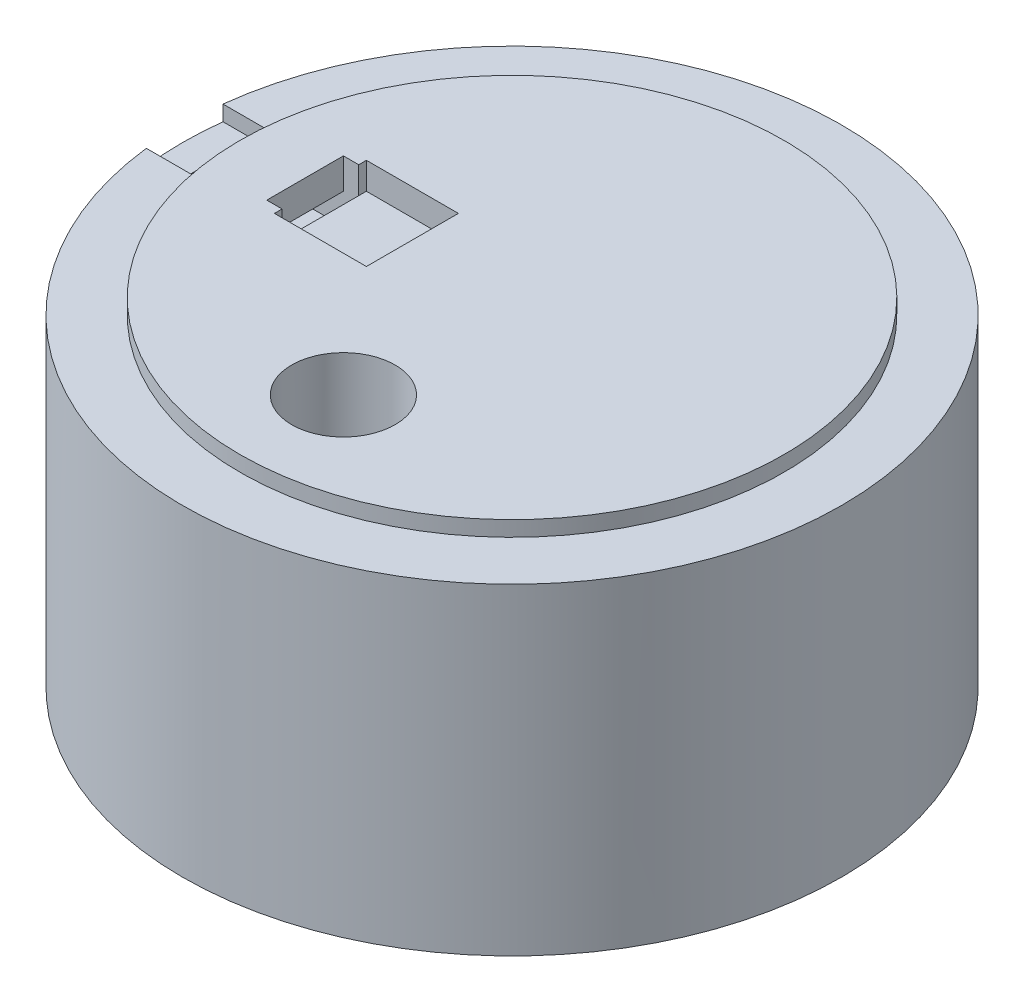
ISO-10303-21;
HEADER;
FILE_DESCRIPTION(('STEP AP214'),'2;1');
FILE_NAME('part.step','',(''),(''),'','','');
FILE_SCHEMA(('AUTOMOTIVE_DESIGN { 1 0 10303 214 1 1 1 1 }'));
ENDSEC;
DATA;
#1=APPLICATION_CONTEXT('core data for automotive mechanical design processes');
#2=APPLICATION_PROTOCOL_DEFINITION('international standard','automotive_design',2000,#1);
#3=PRODUCT_CONTEXT('',#1,'mechanical');
#4=PRODUCT('Part','Part','',(#3));
#5=PRODUCT_RELATED_PRODUCT_CATEGORY('part','',(#4));
#6=PRODUCT_DEFINITION_FORMATION('','',#4);
#7=PRODUCT_DEFINITION_CONTEXT('part definition',#1,'design');
#8=PRODUCT_DEFINITION('design','',#6,#7);
#9=PRODUCT_DEFINITION_SHAPE('','',#8);
#10=(LENGTH_UNIT() NAMED_UNIT(*) SI_UNIT(.MILLI.,.METRE.));
#11=(NAMED_UNIT(*) PLANE_ANGLE_UNIT() SI_UNIT($,.RADIAN.));
#12=(NAMED_UNIT(*) SI_UNIT($,.STERADIAN.) SOLID_ANGLE_UNIT());
#13=UNCERTAINTY_MEASURE_WITH_UNIT(LENGTH_MEASURE(1.E-05),#10,'distance_accuracy_value','');
#14=(GEOMETRIC_REPRESENTATION_CONTEXT(3) GLOBAL_UNCERTAINTY_ASSIGNED_CONTEXT((#13)) GLOBAL_UNIT_ASSIGNED_CONTEXT((#10,
#11,#12)) REPRESENTATION_CONTEXT('',''));
#15=CARTESIAN_POINT('',(0.,0.,0.));
#16=DIRECTION('',(0.,0.,1.));
#17=DIRECTION('',(1.,0.,0.));
#18=AXIS2_PLACEMENT_3D('',#15,#16,#17);
#19=CARTESIAN_POINT('',(0.,30.,0.));
#20=DIRECTION('',(0.,-1.,0.));
#21=DIRECTION('',(0.,0.,-1.));
#22=AXIS2_PLACEMENT_3D('',#19,#20,#21);
#23=PLANE('',#22);
#24=CARTESIAN_POINT('',(0.,30.,0.));
#25=DIRECTION('',(0.,-1.,0.));
#26=DIRECTION('',(0.,0.,-1.));
#27=AXIS2_PLACEMENT_3D('',#24,#25,#26);
#28=CIRCLE('',#27,33.);
#29=CARTESIAN_POINT('',(-3.5,30.,32.8138690190596));
#30=VERTEX_POINT('',#29);
#31=CARTESIAN_POINT('',(-30.1676441669608,30.,-13.3758455962843));
#32=VERTEX_POINT('',#31);
#33=EDGE_CURVE('E306',#30,#32,#28,.T.);
#34=ORIENTED_EDGE('',*,*,#33,.T.);
#35=DIRECTION('',(-0.866025403784438,0.,-0.5));
#36=VECTOR('',#35,1.);
#37=CARTESIAN_POINT('',(-34.2259526419164,30.,-15.7189110867545));
#38=LINE('',#37,#36);
#39=CARTESIAN_POINT('',(-34.2259526419164,30.,-15.7189110867545));
#40=VERTEX_POINT('',#39);
#41=EDGE_CURVE('E309',#32,#40,#38,.T.);
#42=ORIENTED_EDGE('',*,*,#41,.T.);
#43=DIRECTION('',(0.5,0.,-0.866025403784438));
#44=VECTOR('',#43,1.);
#45=CARTESIAN_POINT('',(-30.7259526419164,30.,-21.7810889132456));
#46=LINE('',#45,#44);
#47=CARTESIAN_POINT('',(-30.7259526419164,30.,-21.7810889132456));
#48=VERTEX_POINT('',#47);
#49=EDGE_CURVE('E313',#40,#48,#46,.T.);
#50=ORIENTED_EDGE('',*,*,#49,.T.);
#51=DIRECTION('',(0.866025403784438,0.,0.500000000000001));
#52=VECTOR('',#51,1.);
#53=CARTESIAN_POINT('',(-26.6676441669608,30.,-19.4380234227754));
#54=LINE('',#53,#52);
#55=CARTESIAN_POINT('',(-26.6676441669608,30.,-19.4380234227753));
#56=VERTEX_POINT('',#55);
#57=EDGE_CURVE('E316',#48,#56,#54,.T.);
#58=ORIENTED_EDGE('',*,*,#57,.T.);
#59=CARTESIAN_POINT('',(0.,30.,0.));
#60=DIRECTION('',(0.,-1.,0.));
#61=DIRECTION('',(0.,0.,-1.));
#62=AXIS2_PLACEMENT_3D('',#59,#60,#61);
#63=CIRCLE('',#62,33.);
#64=CARTESIAN_POINT('',(26.6676441669608,30.,-19.4380234227753));
#65=VERTEX_POINT('',#64);
#66=EDGE_CURVE('E319',#56,#65,#63,.T.);
#67=ORIENTED_EDGE('',*,*,#66,.T.);
#68=DIRECTION('',(0.866025403784438,0.,-0.5));
#69=VECTOR('',#68,1.);
#70=CARTESIAN_POINT('',(30.7259526419165,30.,-21.7810889132455));
#71=LINE('',#70,#69);
#72=CARTESIAN_POINT('',(30.7259526419165,30.,-21.7810889132455));
#73=VERTEX_POINT('',#72);
#74=EDGE_CURVE('E322',#65,#73,#71,.T.);
#75=ORIENTED_EDGE('',*,*,#74,.T.);
#76=DIRECTION('',(0.5,0.,0.866025403784439));
#77=VECTOR('',#76,1.);
#78=CARTESIAN_POINT('',(34.2259526419165,30.,-15.7189110867545));
#79=LINE('',#78,#77);
#80=CARTESIAN_POINT('',(34.2259526419165,30.,-15.7189110867545));
#81=VERTEX_POINT('',#80);
#82=EDGE_CURVE('E325',#73,#81,#79,.T.);
#83=ORIENTED_EDGE('',*,*,#82,.T.);
#84=DIRECTION('',(-0.866025403784439,0.,0.5));
#85=VECTOR('',#84,1.);
#86=CARTESIAN_POINT('',(30.1676441669608,30.,-13.3758455962843));
#87=LINE('',#86,#85);
#88=CARTESIAN_POINT('',(30.1676441669608,30.,-13.3758455962843));
#89=VERTEX_POINT('',#88);
#90=EDGE_CURVE('E328',#81,#89,#87,.T.);
#91=ORIENTED_EDGE('',*,*,#90,.T.);
#92=CARTESIAN_POINT('',(0.,30.,0.));
#93=DIRECTION('',(0.,-1.,0.));
#94=DIRECTION('',(0.,0.,-1.));
#95=AXIS2_PLACEMENT_3D('',#92,#93,#94);
#96=CIRCLE('',#95,33.);
#97=CARTESIAN_POINT('',(3.5,30.,32.8138690190596));
#98=VERTEX_POINT('',#97);
#99=EDGE_CURVE('E331',#89,#98,#96,.T.);
#100=ORIENTED_EDGE('',*,*,#99,.T.);
#101=DIRECTION('',(0.,0.,1.));
#102=VECTOR('',#101,1.);
#103=CARTESIAN_POINT('',(3.5,30.,37.5));
#104=LINE('',#103,#102);
#105=CARTESIAN_POINT('',(3.5,30.,37.5));
#106=VERTEX_POINT('',#105);
#107=EDGE_CURVE('E334',#98,#106,#104,.T.);
#108=ORIENTED_EDGE('',*,*,#107,.T.);
#109=DIRECTION('',(-1.,0.,0.));
#110=VECTOR('',#109,1.);
#111=CARTESIAN_POINT('',(-3.5,30.,37.5));
#112=LINE('',#111,#110);
#113=CARTESIAN_POINT('',(-3.5,30.,37.5));
#114=VERTEX_POINT('',#113);
#115=EDGE_CURVE('E337',#106,#114,#112,.T.);
#116=ORIENTED_EDGE('',*,*,#115,.T.);
#117=DIRECTION('',(0.,0.,-1.));
#118=VECTOR('',#117,1.);
#119=CARTESIAN_POINT('',(-3.5,30.,32.8138690190596));
#120=LINE('',#119,#118);
#121=EDGE_CURVE('E340',#114,#30,#120,.T.);
#122=ORIENTED_EDGE('',*,*,#121,.T.);
#123=EDGE_LOOP('',(#34,#42,#50,#58,#67,#75,#83,#91,#100,#108,#116,#122));
#124=FACE_BOUND('',#123,.T.);
#125=CARTESIAN_POINT('',(0.,30.,22.));
#126=DIRECTION('',(0.,-1.,0.));
#127=DIRECTION('',(0.,0.,-1.));
#128=AXIS2_PLACEMENT_3D('',#125,#126,#127);
#129=CIRCLE('',#128,8.75);
#130=CARTESIAN_POINT('',(0.,30.,13.25));
#131=VERTEX_POINT('',#130);
#132=EDGE_CURVE('E613',#131,#131,#129,.T.);
#133=ORIENTED_EDGE('',*,*,#132,.F.);
#134=EDGE_LOOP('',(#133));
#135=FACE_BOUND('',#134,.T.);
#136=ADVANCED_FACE('F38',(#124,#135),#23,.T.);
#137=CARTESIAN_POINT('',(0.,44.,0.));
#138=DIRECTION('',(0.,-1.,0.));
#139=DIRECTION('',(0.,0.,-1.));
#140=AXIS2_PLACEMENT_3D('',#137,#138,#139);
#141=CYLINDRICAL_SURFACE('',#140,35.5);
#142=CARTESIAN_POINT('',(0.,44.,0.));
#143=DIRECTION('',(0.,1.,0.));
#144=DIRECTION('',(0.,0.,1.));
#145=AXIS2_PLACEMENT_3D('',#142,#143,#144);
#146=CIRCLE('',#145,35.5);
#147=CARTESIAN_POINT('',(0.,44.,35.5));
#148=VERTEX_POINT('',#147);
#149=EDGE_CURVE('E379',#148,#148,#146,.T.);
#150=ORIENTED_EDGE('',*,*,#149,.F.);
#151=EDGE_LOOP('',(#150));
#152=FACE_BOUND('',#151,.T.);
#153=DIRECTION('',(0.,1.,0.));
#154=VECTOR('',#153,1.);
#155=CARTESIAN_POINT('',(-35.1461235415799,40.,-4.99999999999999));
#156=LINE('',#155,#154);
#157=CARTESIAN_POINT('',(-35.1461235415799,40.,-5.));
#158=VERTEX_POINT('',#157);
#159=CARTESIAN_POINT('',(-35.1461235415799,42.,-4.99999999999999));
#160=VERTEX_POINT('',#159);
#161=EDGE_CURVE('E506',#158,#160,#156,.T.);
#162=ORIENTED_EDGE('',*,*,#161,.F.);
#163=CARTESIAN_POINT('',(0.,40.,0.));
#164=DIRECTION('',(0.,1.,0.));
#165=DIRECTION('',(0.,0.,1.));
#166=AXIS2_PLACEMENT_3D('',#163,#164,#165);
#167=CIRCLE('',#166,35.5);
#168=CARTESIAN_POINT('',(-35.1461235415799,40.,5.));
#169=VERTEX_POINT('',#168);
#170=EDGE_CURVE('E240',#158,#169,#167,.T.);
#171=ORIENTED_EDGE('',*,*,#170,.T.);
#172=DIRECTION('',(0.,1.,0.));
#173=VECTOR('',#172,1.);
#174=CARTESIAN_POINT('',(-35.1461235415799,40.,4.99999999999999));
#175=LINE('',#174,#173);
#176=CARTESIAN_POINT('',(-35.1461235415799,42.,5.));
#177=VERTEX_POINT('',#176);
#178=EDGE_CURVE('E515',#169,#177,#175,.T.);
#179=ORIENTED_EDGE('',*,*,#178,.T.);
#180=CARTESIAN_POINT('',(0.,42.,0.));
#181=DIRECTION('',(0.,1.,0.));
#182=DIRECTION('',(0.,0.,1.));
#183=AXIS2_PLACEMENT_3D('',#180,#181,#182);
#184=CIRCLE('',#183,35.5);
#185=EDGE_CURVE('E11',#177,#160,#184,.T.);
#186=ORIENTED_EDGE('',*,*,#185,.T.);
#187=EDGE_LOOP('',(#162,#171,#179,#186));
#188=FACE_BOUND('',#187,.T.);
#189=ADVANCED_FACE('F425',(#152,#188),#141,.T.);
#190=CARTESIAN_POINT('',(-25.,40.5,-6.));
#191=DIRECTION('',(-1.,0.,0.));
#192=DIRECTION('',(0.,0.,1.));
#193=AXIS2_PLACEMENT_3D('',#190,#191,#192);
#194=PLANE('',#193);
#195=DIRECTION('',(0.,0.,1.));
#196=VECTOR('',#195,1.);
#197=CARTESIAN_POINT('',(-25.,44.,-6.));
#198=LINE('',#197,#196);
#199=CARTESIAN_POINT('',(-25.,44.,-6.));
#200=VERTEX_POINT('',#199);
#201=CARTESIAN_POINT('',(-25.,44.,-5.));
#202=VERTEX_POINT('',#201);
#203=EDGE_CURVE('E260',#200,#202,#198,.T.);
#204=ORIENTED_EDGE('',*,*,#203,.T.);
#205=DIRECTION('',(0.,1.,0.));
#206=VECTOR('',#205,1.);
#207=CARTESIAN_POINT('',(-25.,36.,-5.));
#208=LINE('',#207,#206);
#209=CARTESIAN_POINT('',(-25.,40.5,-5.));
#210=VERTEX_POINT('',#209);
#211=EDGE_CURVE('E263',#210,#202,#208,.T.);
#212=ORIENTED_EDGE('',*,*,#211,.F.);
#213=DIRECTION('',(0.,0.,1.));
#214=VECTOR('',#213,1.);
#215=CARTESIAN_POINT('',(-25.,40.5,-6.));
#216=LINE('',#215,#214);
#217=CARTESIAN_POINT('',(-25.,40.5,-6.));
#218=VERTEX_POINT('',#217);
#219=EDGE_CURVE('E272',#218,#210,#216,.T.);
#220=ORIENTED_EDGE('',*,*,#219,.F.);
#221=DIRECTION('',(0.,1.,0.));
#222=VECTOR('',#221,1.);
#223=CARTESIAN_POINT('',(-25.,40.5,-6.));
#224=LINE('',#223,#222);
#225=EDGE_CURVE('E297',#218,#200,#224,.T.);
#226=ORIENTED_EDGE('',*,*,#225,.T.);
#227=EDGE_LOOP('',(#204,#212,#220,#226));
#228=FACE_BOUND('',#227,.T.);
#229=ADVANCED_FACE('F437',(#228),#194,.F.);
#230=CARTESIAN_POINT('',(0.,42.,0.));
#231=DIRECTION('',(0.,-1.,0.));
#232=DIRECTION('',(0.,0.,-1.));
#233=AXIS2_PLACEMENT_3D('',#230,#231,#232);
#234=CYLINDRICAL_SURFACE('',#233,43.);
#235=CARTESIAN_POINT('',(0.,40.,0.));
#236=DIRECTION('',(0.,1.,0.));
#237=DIRECTION('',(0.,0.,1.));
#238=AXIS2_PLACEMENT_3D('',#235,#236,#237);
#239=CIRCLE('',#238,43.);
#240=CARTESIAN_POINT('',(-42.7083130081252,40.,-4.99999999999999));
#241=VERTEX_POINT('',#240);
#242=CARTESIAN_POINT('',(-42.7083130081252,40.,5.00000000000001));
#243=VERTEX_POINT('',#242);
#244=EDGE_CURVE('E641',#241,#243,#239,.T.);
#245=ORIENTED_EDGE('',*,*,#244,.F.);
#246=DIRECTION('',(0.,1.,0.));
#247=VECTOR('',#246,1.);
#248=CARTESIAN_POINT('',(-42.7083130081252,40.,-4.99999999999999));
#249=LINE('',#248,#247);
#250=CARTESIAN_POINT('',(-42.7083130081252,42.,-4.99999999999999));
#251=VERTEX_POINT('',#250);
#252=EDGE_CURVE('E513',#241,#251,#249,.T.);
#253=ORIENTED_EDGE('',*,*,#252,.T.);
#254=CARTESIAN_POINT('',(0.,42.,0.));
#255=DIRECTION('',(0.,1.,0.));
#256=DIRECTION('',(0.,0.,1.));
#257=AXIS2_PLACEMENT_3D('',#254,#255,#256);
#258=CIRCLE('',#257,43.);
#259=CARTESIAN_POINT('',(-42.7083130081252,42.,5.00000000000001));
#260=VERTEX_POINT('',#259);
#261=EDGE_CURVE('E47',#260,#251,#258,.T.);
#262=ORIENTED_EDGE('',*,*,#261,.F.);
#263=DIRECTION('',(0.,1.,0.));
#264=VECTOR('',#263,1.);
#265=CARTESIAN_POINT('',(-42.7083130081252,40.,5.00000000000001));
#266=LINE('',#265,#264);
#267=EDGE_CURVE('E520',#243,#260,#266,.T.);
#268=ORIENTED_EDGE('',*,*,#267,.F.);
#269=EDGE_LOOP('',(#245,#253,#262,#268));
#270=FACE_BOUND('',#269,.T.);
#271=CARTESIAN_POINT('',(0.,0.,0.));
#272=DIRECTION('',(0.,1.,0.));
#273=DIRECTION('',(0.,0.,1.));
#274=AXIS2_PLACEMENT_3D('',#271,#272,#273);
#275=CIRCLE('',#274,43.);
#276=CARTESIAN_POINT('',(0.,0.,43.));
#277=VERTEX_POINT('',#276);
#278=EDGE_CURVE('E42',#277,#277,#275,.T.);
#279=ORIENTED_EDGE('',*,*,#278,.T.);
#280=EDGE_LOOP('',(#279));
#281=FACE_BOUND('',#280,.T.);
#282=ADVANCED_FACE('F40',(#270,#281),#234,.T.);
#283=CARTESIAN_POINT('',(0.,42.,0.));
#284=DIRECTION('',(0.,1.,0.));
#285=DIRECTION('',(0.,0.,1.));
#286=AXIS2_PLACEMENT_3D('',#283,#284,#285);
#287=PLANE('',#286);
#288=DIRECTION('',(-1.,0.,0.));
#289=VECTOR('',#288,1.);
#290=CARTESIAN_POINT('',(-42.7083130081252,42.,-4.99999999999999));
#291=LINE('',#290,#289);
#292=EDGE_CURVE('E645',#160,#251,#291,.T.);
#293=ORIENTED_EDGE('',*,*,#292,.F.);
#294=ORIENTED_EDGE('',*,*,#185,.F.);
#295=DIRECTION('',(1.,0.,0.));
#296=VECTOR('',#295,1.);
#297=CARTESIAN_POINT('',(-42.7083130081252,42.,5.00000000000001));
#298=LINE('',#297,#296);
#299=EDGE_CURVE('E640',#260,#177,#298,.T.);
#300=ORIENTED_EDGE('',*,*,#299,.F.);
#301=ORIENTED_EDGE('',*,*,#261,.T.);
#302=EDGE_LOOP('',(#293,#294,#300,#301));
#303=FACE_BOUND('',#302,.T.);
#304=ADVANCED_FACE('F415',(#303),#287,.T.);
#305=CARTESIAN_POINT('',(0.,0.,0.));
#306=DIRECTION('',(0.,1.,0.));
#307=DIRECTION('',(0.,0.,1.));
#308=AXIS2_PLACEMENT_3D('',#305,#306,#307);
#309=PLANE('',#308);
#310=DIRECTION('',(1.,0.,0.));
#311=VECTOR('',#310,1.);
#312=CARTESIAN_POINT('',(0.,0.,5.));
#313=LINE('',#312,#311);
#314=CARTESIAN_POINT('',(-38.9272182748526,0.,5.));
#315=VERTEX_POINT('',#314);
#316=CARTESIAN_POINT('',(-35.1461235415799,0.,5.));
#317=VERTEX_POINT('',#316);
#318=EDGE_CURVE('E635',#315,#317,#313,.T.);
#319=ORIENTED_EDGE('',*,*,#318,.T.);
#320=CARTESIAN_POINT('',(0.,0.,0.));
#321=DIRECTION('',(0.,1.,0.));
#322=DIRECTION('',(0.,0.,1.));
#323=AXIS2_PLACEMENT_3D('',#320,#321,#322);
#324=CIRCLE('',#323,35.5);
#325=CARTESIAN_POINT('',(-35.1461235415799,0.,-4.99999999999999));
#326=VERTEX_POINT('',#325);
#327=EDGE_CURVE('E637',#317,#326,#324,.F.);
#328=ORIENTED_EDGE('',*,*,#327,.T.);
#329=DIRECTION('',(-1.,0.,0.));
#330=VECTOR('',#329,1.);
#331=CARTESIAN_POINT('',(0.,0.,-4.99999999999999));
#332=LINE('',#331,#330);
#333=CARTESIAN_POINT('',(-38.9272182748526,0.,-4.99999999999999));
#334=VERTEX_POINT('',#333);
#335=EDGE_CURVE('E628',#326,#334,#332,.T.);
#336=ORIENTED_EDGE('',*,*,#335,.T.);
#337=DIRECTION('',(0.,0.,1.));
#338=VECTOR('',#337,1.);
#339=CARTESIAN_POINT('',(-38.9272182748526,0.,0.));
#340=LINE('',#339,#338);
#341=EDGE_CURVE('E632',#334,#315,#340,.T.);
#342=ORIENTED_EDGE('',*,*,#341,.T.);
#343=EDGE_LOOP('',(#319,#328,#336,#342));
#344=FACE_BOUND('',#343,.T.);
#345=DIRECTION('',(-0.866025403784438,0.,-0.5));
#346=VECTOR('',#345,1.);
#347=CARTESIAN_POINT('',(-34.2259526419164,0.,-15.7189110867545));
#348=LINE('',#347,#346);
#349=CARTESIAN_POINT('',(-30.1676441669608,0.,-13.3758455962843));
#350=VERTEX_POINT('',#349);
#351=CARTESIAN_POINT('',(-34.2259526419164,0.,-15.7189110867545));
#352=VERTEX_POINT('',#351);
#353=EDGE_CURVE('E345',#350,#352,#348,.T.);
#354=ORIENTED_EDGE('',*,*,#353,.F.);
#355=CARTESIAN_POINT('',(0.,0.,0.));
#356=DIRECTION('',(0.,-1.,0.));
#357=DIRECTION('',(0.,0.,-1.));
#358=AXIS2_PLACEMENT_3D('',#355,#356,#357);
#359=CIRCLE('',#358,33.);
#360=CARTESIAN_POINT('',(-3.5,0.,32.8138690190596));
#361=VERTEX_POINT('',#360);
#362=EDGE_CURVE('E299',#361,#350,#359,.T.);
#363=ORIENTED_EDGE('',*,*,#362,.F.);
#364=DIRECTION('',(0.,0.,-1.));
#365=VECTOR('',#364,1.);
#366=CARTESIAN_POINT('',(-3.5,0.,32.8138690190596));
#367=LINE('',#366,#365);
#368=CARTESIAN_POINT('',(-3.5,0.,37.5));
#369=VERTEX_POINT('',#368);
#370=EDGE_CURVE('E310',#369,#361,#367,.T.);
#371=ORIENTED_EDGE('',*,*,#370,.F.);
#372=DIRECTION('',(-1.,0.,0.));
#373=VECTOR('',#372,1.);
#374=CARTESIAN_POINT('',(-3.5,0.,37.5));
#375=LINE('',#374,#373);
#376=CARTESIAN_POINT('',(3.5,0.,37.5));
#377=VERTEX_POINT('',#376);
#378=EDGE_CURVE('E372',#377,#369,#375,.T.);
#379=ORIENTED_EDGE('',*,*,#378,.F.);
#380=DIRECTION('',(0.,0.,1.));
#381=VECTOR('',#380,1.);
#382=CARTESIAN_POINT('',(3.5,0.,37.5));
#383=LINE('',#382,#381);
#384=CARTESIAN_POINT('',(3.5,0.,32.8138690190596));
#385=VERTEX_POINT('',#384);
#386=EDGE_CURVE('E369',#385,#377,#383,.T.);
#387=ORIENTED_EDGE('',*,*,#386,.F.);
#388=CARTESIAN_POINT('',(0.,0.,0.));
#389=DIRECTION('',(0.,-1.,0.));
#390=DIRECTION('',(0.,0.,-1.));
#391=AXIS2_PLACEMENT_3D('',#388,#389,#390);
#392=CIRCLE('',#391,33.);
#393=CARTESIAN_POINT('',(30.1676441669608,0.,-13.3758455962843));
#394=VERTEX_POINT('',#393);
#395=EDGE_CURVE('E366',#394,#385,#392,.T.);
#396=ORIENTED_EDGE('',*,*,#395,.F.);
#397=DIRECTION('',(-0.866025403784439,0.,0.5));
#398=VECTOR('',#397,1.);
#399=CARTESIAN_POINT('',(30.1676441669608,0.,-13.3758455962843));
#400=LINE('',#399,#398);
#401=CARTESIAN_POINT('',(34.2259526419165,0.,-15.7189110867545));
#402=VERTEX_POINT('',#401);
#403=EDGE_CURVE('E363',#402,#394,#400,.T.);
#404=ORIENTED_EDGE('',*,*,#403,.F.);
#405=DIRECTION('',(0.5,0.,0.866025403784439));
#406=VECTOR('',#405,1.);
#407=CARTESIAN_POINT('',(34.2259526419165,0.,-15.7189110867545));
#408=LINE('',#407,#406);
#409=CARTESIAN_POINT('',(30.7259526419165,0.,-21.7810889132455));
#410=VERTEX_POINT('',#409);
#411=EDGE_CURVE('E360',#410,#402,#408,.T.);
#412=ORIENTED_EDGE('',*,*,#411,.F.);
#413=DIRECTION('',(0.866025403784438,0.,-0.5));
#414=VECTOR('',#413,1.);
#415=CARTESIAN_POINT('',(30.7259526419165,0.,-21.7810889132455));
#416=LINE('',#415,#414);
#417=CARTESIAN_POINT('',(26.6676441669608,0.,-19.4380234227753));
#418=VERTEX_POINT('',#417);
#419=EDGE_CURVE('E357',#418,#410,#416,.T.);
#420=ORIENTED_EDGE('',*,*,#419,.F.);
#421=CARTESIAN_POINT('',(0.,0.,0.));
#422=DIRECTION('',(0.,-1.,0.));
#423=DIRECTION('',(0.,0.,-1.));
#424=AXIS2_PLACEMENT_3D('',#421,#422,#423);
#425=CIRCLE('',#424,33.);
#426=CARTESIAN_POINT('',(-26.6676441669608,0.,-19.4380234227753));
#427=VERTEX_POINT('',#426);
#428=EDGE_CURVE('E354',#427,#418,#425,.T.);
#429=ORIENTED_EDGE('',*,*,#428,.F.);
#430=DIRECTION('',(0.866025403784438,0.,0.500000000000001));
#431=VECTOR('',#430,1.);
#432=CARTESIAN_POINT('',(-26.6676441669608,0.,-19.4380234227754));
#433=LINE('',#432,#431);
#434=CARTESIAN_POINT('',(-30.7259526419164,0.,-21.7810889132456));
#435=VERTEX_POINT('',#434);
#436=EDGE_CURVE('E351',#435,#427,#433,.T.);
#437=ORIENTED_EDGE('',*,*,#436,.F.);
#438=DIRECTION('',(0.5,0.,-0.866025403784438));
#439=VECTOR('',#438,1.);
#440=CARTESIAN_POINT('',(-30.7259526419164,0.,-21.7810889132456));
#441=LINE('',#440,#439);
#442=EDGE_CURVE('E348',#352,#435,#441,.T.);
#443=ORIENTED_EDGE('',*,*,#442,.F.);
#444=EDGE_LOOP('',(#354,#363,#371,#379,#387,#396,#404,#412,#420,#429,#437,#443));
#445=FACE_BOUND('',#444,.T.);
#446=ORIENTED_EDGE('',*,*,#278,.F.);
#447=EDGE_LOOP('',(#446));
#448=FACE_BOUND('',#447,.T.);
#449=ADVANCED_FACE('F412',(#344,#445,#448),#309,.F.);
#450=CARTESIAN_POINT('',(-35.1461235415799,36.,5.));
#451=VERTEX_POINT('',#450);
#452=EDGE_CURVE('E510',#317,#451,#175,.T.);
#453=ORIENTED_EDGE('',*,*,#452,.T.);
#454=CARTESIAN_POINT('',(0.,36.,0.));
#455=DIRECTION('',(0.,-1.,0.));
#456=DIRECTION('',(0.,0.,-1.));
#457=AXIS2_PLACEMENT_3D('',#454,#455,#456);
#458=CIRCLE('',#457,35.5);
#459=CARTESIAN_POINT('',(-35.1461235415799,36.,-4.99999999999999));
#460=VERTEX_POINT('',#459);
#461=EDGE_CURVE('E619',#451,#460,#458,.T.);
#462=ORIENTED_EDGE('',*,*,#461,.T.);
#463=EDGE_CURVE('E509',#326,#460,#156,.T.);
#464=ORIENTED_EDGE('',*,*,#463,.F.);
#465=ORIENTED_EDGE('',*,*,#327,.F.);
#466=EDGE_LOOP('',(#453,#462,#464,#465));
#467=FACE_BOUND('',#466,.T.);
#468=ADVANCED_FACE('F414',(#467),#141,.T.);
#469=CARTESIAN_POINT('',(0.,44.,0.));
#470=DIRECTION('',(0.,1.,0.));
#471=DIRECTION('',(0.,0.,1.));
#472=AXIS2_PLACEMENT_3D('',#469,#470,#471);
#473=PLANE('',#472);
#474=CARTESIAN_POINT('',(0.,44.,22.));
#475=DIRECTION('',(0.,1.,0.));
#476=DIRECTION('',(0.,0.,1.));
#477=AXIS2_PLACEMENT_3D('',#474,#475,#476);
#478=CIRCLE('',#477,6.75);
#479=CARTESIAN_POINT('',(0.,44.,28.75));
#480=VERTEX_POINT('',#479);
#481=EDGE_CURVE('E501',#480,#480,#478,.T.);
#482=ORIENTED_EDGE('',*,*,#481,.F.);
#483=EDGE_LOOP('',(#482));
#484=FACE_BOUND('',#483,.T.);
#485=DIRECTION('',(-1.,0.,0.));
#486=VECTOR('',#485,1.);
#487=CARTESIAN_POINT('',(-27.,44.,-5.));
#488=LINE('',#487,#486);
#489=CARTESIAN_POINT('',(-27.,44.,-5.));
#490=VERTEX_POINT('',#489);
#491=EDGE_CURVE('E255',#202,#490,#488,.T.);
#492=ORIENTED_EDGE('',*,*,#491,.F.);
#493=ORIENTED_EDGE('',*,*,#203,.F.);
#494=DIRECTION('',(-1.,0.,0.));
#495=VECTOR('',#494,1.);
#496=CARTESIAN_POINT('',(-25.,44.,-6.));
#497=LINE('',#496,#495);
#498=CARTESIAN_POINT('',(-13.,44.,-6.));
#499=VERTEX_POINT('',#498);
#500=EDGE_CURVE('E294',#499,#200,#497,.T.);
#501=ORIENTED_EDGE('',*,*,#500,.F.);
#502=DIRECTION('',(0.,0.,-1.));
#503=VECTOR('',#502,1.);
#504=CARTESIAN_POINT('',(-13.,44.,-6.));
#505=LINE('',#504,#503);
#506=CARTESIAN_POINT('',(-13.,44.,6.));
#507=VERTEX_POINT('',#506);
#508=EDGE_CURVE('E291',#507,#499,#505,.T.);
#509=ORIENTED_EDGE('',*,*,#508,.F.);
#510=DIRECTION('',(1.,0.,0.));
#511=VECTOR('',#510,1.);
#512=CARTESIAN_POINT('',(-25.,44.,6.));
#513=LINE('',#512,#511);
#514=CARTESIAN_POINT('',(-25.,44.,6.));
#515=VERTEX_POINT('',#514);
#516=EDGE_CURVE('E288',#515,#507,#513,.T.);
#517=ORIENTED_EDGE('',*,*,#516,.F.);
#518=CARTESIAN_POINT('',(-25.,44.,5.));
#519=VERTEX_POINT('',#518);
#520=EDGE_CURVE('E257',#519,#515,#198,.T.);
#521=ORIENTED_EDGE('',*,*,#520,.F.);
#522=DIRECTION('',(1.,0.,0.));
#523=VECTOR('',#522,1.);
#524=CARTESIAN_POINT('',(-27.,44.,5.));
#525=LINE('',#524,#523);
#526=CARTESIAN_POINT('',(-27.,44.,5.));
#527=VERTEX_POINT('',#526);
#528=EDGE_CURVE('E531',#527,#519,#525,.T.);
#529=ORIENTED_EDGE('',*,*,#528,.F.);
#530=DIRECTION('',(0.,0.,1.));
#531=VECTOR('',#530,1.);
#532=CARTESIAN_POINT('',(-27.,44.,-5.));
#533=LINE('',#532,#531);
#534=EDGE_CURVE('E524',#490,#527,#533,.T.);
#535=ORIENTED_EDGE('',*,*,#534,.F.);
#536=EDGE_LOOP('',(#492,#493,#501,#509,#517,#521,#529,#535));
#537=FACE_BOUND('',#536,.T.);
#538=ORIENTED_EDGE('',*,*,#149,.T.);
#539=EDGE_LOOP('',(#538));
#540=FACE_BOUND('',#539,.T.);
#541=ADVANCED_FACE('F422',(#484,#537,#540),#473,.T.);
#542=CARTESIAN_POINT('',(0.,30.,0.));
#543=DIRECTION('',(0.,-1.,0.));
#544=DIRECTION('',(0.,0.,-1.));
#545=AXIS2_PLACEMENT_3D('',#542,#543,#544);
#546=CYLINDRICAL_SURFACE('',#545,33.);
#547=ORIENTED_EDGE('',*,*,#362,.T.);
#548=DIRECTION('',(0.,-1.,0.));
#549=VECTOR('',#548,1.);
#550=CARTESIAN_POINT('',(-30.1676441669608,30.,-13.3758455962843));
#551=LINE('',#550,#549);
#552=EDGE_CURVE('E343',#32,#350,#551,.T.);
#553=ORIENTED_EDGE('',*,*,#552,.F.);
#554=ORIENTED_EDGE('',*,*,#33,.F.);
#555=DIRECTION('',(0.,-1.,0.));
#556=VECTOR('',#555,1.);
#557=CARTESIAN_POINT('',(-3.5,30.,32.8138690190596));
#558=LINE('',#557,#556);
#559=EDGE_CURVE('E377',#30,#361,#558,.T.);
#560=ORIENTED_EDGE('',*,*,#559,.T.);
#561=EDGE_LOOP('',(#547,#553,#554,#560));
#562=FACE_BOUND('',#561,.T.);
#563=ADVANCED_FACE('F448',(#562),#546,.F.);
#564=CARTESIAN_POINT('',(-3.5,30.,32.8138690190596));
#565=DIRECTION('',(-1.,0.,0.));
#566=DIRECTION('',(0.,0.,1.));
#567=AXIS2_PLACEMENT_3D('',#564,#565,#566);
#568=PLANE('',#567);
#569=ORIENTED_EDGE('',*,*,#370,.T.);
#570=ORIENTED_EDGE('',*,*,#559,.F.);
#571=ORIENTED_EDGE('',*,*,#121,.F.);
#572=DIRECTION('',(0.,-1.,0.));
#573=VECTOR('',#572,1.);
#574=CARTESIAN_POINT('',(-3.5,30.,37.5));
#575=LINE('',#574,#573);
#576=EDGE_CURVE('E380',#114,#369,#575,.T.);
#577=ORIENTED_EDGE('',*,*,#576,.T.);
#578=EDGE_LOOP('',(#569,#570,#571,#577));
#579=FACE_BOUND('',#578,.T.);
#580=ADVANCED_FACE('F444',(#579),#568,.F.);
#581=CARTESIAN_POINT('',(-3.5,30.,37.5));
#582=DIRECTION('',(0.,0.,1.));
#583=DIRECTION('',(1.,0.,0.));
#584=AXIS2_PLACEMENT_3D('',#581,#582,#583);
#585=PLANE('',#584);
#586=ORIENTED_EDGE('',*,*,#378,.T.);
#587=ORIENTED_EDGE('',*,*,#576,.F.);
#588=ORIENTED_EDGE('',*,*,#115,.F.);
#589=DIRECTION('',(0.,-1.,0.));
#590=VECTOR('',#589,1.);
#591=CARTESIAN_POINT('',(3.5,30.,37.5));
#592=LINE('',#591,#590);
#593=EDGE_CURVE('E382',#106,#377,#592,.T.);
#594=ORIENTED_EDGE('',*,*,#593,.T.);
#595=EDGE_LOOP('',(#586,#587,#588,#594));
#596=FACE_BOUND('',#595,.T.);
#597=ADVANCED_FACE('F447',(#596),#585,.F.);
#598=CARTESIAN_POINT('',(3.5,30.,37.5));
#599=DIRECTION('',(1.,0.,0.));
#600=DIRECTION('',(0.,0.,-1.));
#601=AXIS2_PLACEMENT_3D('',#598,#599,#600);
#602=PLANE('',#601);
#603=ORIENTED_EDGE('',*,*,#386,.T.);
#604=ORIENTED_EDGE('',*,*,#593,.F.);
#605=ORIENTED_EDGE('',*,*,#107,.F.);
#606=DIRECTION('',(0.,-1.,0.));
#607=VECTOR('',#606,1.);
#608=CARTESIAN_POINT('',(3.5,30.,32.8138690190596));
#609=LINE('',#608,#607);
#610=EDGE_CURVE('E384',#98,#385,#609,.T.);
#611=ORIENTED_EDGE('',*,*,#610,.T.);
#612=EDGE_LOOP('',(#603,#604,#605,#611));
#613=FACE_BOUND('',#612,.T.);
#614=ADVANCED_FACE('F452',(#613),#602,.F.);
#615=CARTESIAN_POINT('',(0.,30.,0.));
#616=DIRECTION('',(0.,-1.,0.));
#617=DIRECTION('',(0.,0.,-1.));
#618=AXIS2_PLACEMENT_3D('',#615,#616,#617);
#619=CYLINDRICAL_SURFACE('',#618,33.);
#620=ORIENTED_EDGE('',*,*,#395,.T.);
#621=ORIENTED_EDGE('',*,*,#610,.F.);
#622=ORIENTED_EDGE('',*,*,#99,.F.);
#623=DIRECTION('',(0.,-1.,0.));
#624=VECTOR('',#623,1.);
#625=CARTESIAN_POINT('',(30.1676441669608,30.,-13.3758455962843));
#626=LINE('',#625,#624);
#627=EDGE_CURVE('E386',#89,#394,#626,.T.);
#628=ORIENTED_EDGE('',*,*,#627,.T.);
#629=EDGE_LOOP('',(#620,#621,#622,#628));
#630=FACE_BOUND('',#629,.T.);
#631=ADVANCED_FACE('F456',(#630),#619,.F.);
#632=CARTESIAN_POINT('',(30.1676441669608,30.,-13.3758455962843));
#633=DIRECTION('',(0.5,0.,0.866025403784439));
#634=DIRECTION('',(0.866025403784439,0.,-0.5));
#635=AXIS2_PLACEMENT_3D('',#632,#633,#634);
#636=PLANE('',#635);
#637=ORIENTED_EDGE('',*,*,#403,.T.);
#638=ORIENTED_EDGE('',*,*,#627,.F.);
#639=ORIENTED_EDGE('',*,*,#90,.F.);
#640=DIRECTION('',(0.,-1.,0.));
#641=VECTOR('',#640,1.);
#642=CARTESIAN_POINT('',(34.2259526419165,30.,-15.7189110867545));
#643=LINE('',#642,#641);
#644=EDGE_CURVE('E388',#81,#402,#643,.T.);
#645=ORIENTED_EDGE('',*,*,#644,.T.);
#646=EDGE_LOOP('',(#637,#638,#639,#645));
#647=FACE_BOUND('',#646,.T.);
#648=ADVANCED_FACE('F460',(#647),#636,.F.);
#649=CARTESIAN_POINT('',(34.2259526419165,30.,-15.7189110867545));
#650=DIRECTION('',(0.866025403784439,0.,-0.5));
#651=DIRECTION('',(-0.5,0.,-0.866025403784439));
#652=AXIS2_PLACEMENT_3D('',#649,#650,#651);
#653=PLANE('',#652);
#654=ORIENTED_EDGE('',*,*,#411,.T.);
#655=ORIENTED_EDGE('',*,*,#644,.F.);
#656=ORIENTED_EDGE('',*,*,#82,.F.);
#657=DIRECTION('',(0.,-1.,0.));
#658=VECTOR('',#657,1.);
#659=CARTESIAN_POINT('',(30.7259526419165,30.,-21.7810889132455));
#660=LINE('',#659,#658);
#661=EDGE_CURVE('E390',#73,#410,#660,.T.);
#662=ORIENTED_EDGE('',*,*,#661,.T.);
#663=EDGE_LOOP('',(#654,#655,#656,#662));
#664=FACE_BOUND('',#663,.T.);
#665=ADVANCED_FACE('F464',(#664),#653,.F.);
#666=CARTESIAN_POINT('',(30.7259526419165,30.,-21.7810889132455));
#667=DIRECTION('',(-0.5,0.,-0.866025403784438));
#668=DIRECTION('',(-0.866025403784439,0.,0.5));
#669=AXIS2_PLACEMENT_3D('',#666,#667,#668);
#670=PLANE('',#669);
#671=ORIENTED_EDGE('',*,*,#419,.T.);
#672=ORIENTED_EDGE('',*,*,#661,.F.);
#673=ORIENTED_EDGE('',*,*,#74,.F.);
#674=DIRECTION('',(0.,-1.,0.));
#675=VECTOR('',#674,1.);
#676=CARTESIAN_POINT('',(26.6676441669608,30.,-19.4380234227753));
#677=LINE('',#676,#675);
#678=EDGE_CURVE('E392',#65,#418,#677,.T.);
#679=ORIENTED_EDGE('',*,*,#678,.T.);
#680=EDGE_LOOP('',(#671,#672,#673,#679));
#681=FACE_BOUND('',#680,.T.);
#682=ADVANCED_FACE('F468',(#681),#670,.F.);
#683=CARTESIAN_POINT('',(0.,30.,0.));
#684=DIRECTION('',(0.,-1.,0.));
#685=DIRECTION('',(0.,0.,-1.));
#686=AXIS2_PLACEMENT_3D('',#683,#684,#685);
#687=CYLINDRICAL_SURFACE('',#686,33.);
#688=ORIENTED_EDGE('',*,*,#428,.T.);
#689=ORIENTED_EDGE('',*,*,#678,.F.);
#690=ORIENTED_EDGE('',*,*,#66,.F.);
#691=DIRECTION('',(0.,-1.,0.));
#692=VECTOR('',#691,1.);
#693=CARTESIAN_POINT('',(-26.6676441669608,30.,-19.4380234227753));
#694=LINE('',#693,#692);
#695=EDGE_CURVE('E394',#56,#427,#694,.T.);
#696=ORIENTED_EDGE('',*,*,#695,.T.);
#697=EDGE_LOOP('',(#688,#689,#690,#696));
#698=FACE_BOUND('',#697,.T.);
#699=ADVANCED_FACE('F472',(#698),#687,.F.);
#700=CARTESIAN_POINT('',(-26.6676441669608,30.,-19.4380234227754));
#701=DIRECTION('',(0.500000000000001,0.,-0.866025403784438));
#702=DIRECTION('',(-0.866025403784438,0.,-0.500000000000001));
#703=AXIS2_PLACEMENT_3D('',#700,#701,#702);
#704=PLANE('',#703);
#705=ORIENTED_EDGE('',*,*,#436,.T.);
#706=ORIENTED_EDGE('',*,*,#695,.F.);
#707=ORIENTED_EDGE('',*,*,#57,.F.);
#708=DIRECTION('',(0.,-1.,0.));
#709=VECTOR('',#708,1.);
#710=CARTESIAN_POINT('',(-30.7259526419164,30.,-21.7810889132456));
#711=LINE('',#710,#709);
#712=EDGE_CURVE('E396',#48,#435,#711,.T.);
#713=ORIENTED_EDGE('',*,*,#712,.T.);
#714=EDGE_LOOP('',(#705,#706,#707,#713));
#715=FACE_BOUND('',#714,.T.);
#716=ADVANCED_FACE('F476',(#715),#704,.F.);
#717=CARTESIAN_POINT('',(-30.7259526419164,30.,-21.7810889132456));
#718=DIRECTION('',(-0.866025403784438,0.,-0.5));
#719=DIRECTION('',(-0.5,0.,0.866025403784439));
#720=AXIS2_PLACEMENT_3D('',#717,#718,#719);
#721=PLANE('',#720);
#722=ORIENTED_EDGE('',*,*,#442,.T.);
#723=ORIENTED_EDGE('',*,*,#712,.F.);
#724=ORIENTED_EDGE('',*,*,#49,.F.);
#725=DIRECTION('',(0.,-1.,0.));
#726=VECTOR('',#725,1.);
#727=CARTESIAN_POINT('',(-34.2259526419164,30.,-15.7189110867545));
#728=LINE('',#727,#726);
#729=EDGE_CURVE('E398',#40,#352,#728,.T.);
#730=ORIENTED_EDGE('',*,*,#729,.T.);
#731=EDGE_LOOP('',(#722,#723,#724,#730));
#732=FACE_BOUND('',#731,.T.);
#733=ADVANCED_FACE('F480',(#732),#721,.F.);
#734=CARTESIAN_POINT('',(-34.2259526419164,30.,-15.7189110867545));
#735=DIRECTION('',(-0.5,0.,0.866025403784438));
#736=DIRECTION('',(0.866025403784438,0.,0.5));
#737=AXIS2_PLACEMENT_3D('',#734,#735,#736);
#738=PLANE('',#737);
#739=ORIENTED_EDGE('',*,*,#353,.T.);
#740=ORIENTED_EDGE('',*,*,#729,.F.);
#741=ORIENTED_EDGE('',*,*,#41,.F.);
#742=ORIENTED_EDGE('',*,*,#552,.T.);
#743=EDGE_LOOP('',(#739,#740,#741,#742));
#744=FACE_BOUND('',#743,.T.);
#745=ADVANCED_FACE('F484',(#744),#738,.F.);
#746=CARTESIAN_POINT('',(-25.,40.5,5.));
#747=VERTEX_POINT('',#746);
#748=CARTESIAN_POINT('',(-25.,40.5,6.));
#749=VERTEX_POINT('',#748);
#750=EDGE_CURVE('E277',#747,#749,#216,.T.);
#751=ORIENTED_EDGE('',*,*,#750,.F.);
#752=DIRECTION('',(0.,1.,0.));
#753=VECTOR('',#752,1.);
#754=CARTESIAN_POINT('',(-25.,36.,5.));
#755=LINE('',#754,#753);
#756=EDGE_CURVE('E270',#747,#519,#755,.T.);
#757=ORIENTED_EDGE('',*,*,#756,.T.);
#758=ORIENTED_EDGE('',*,*,#520,.T.);
#759=DIRECTION('',(0.,1.,0.));
#760=VECTOR('',#759,1.);
#761=CARTESIAN_POINT('',(-25.,40.5,6.));
#762=LINE('',#761,#760);
#763=EDGE_CURVE('E285',#749,#515,#762,.T.);
#764=ORIENTED_EDGE('',*,*,#763,.F.);
#765=EDGE_LOOP('',(#751,#757,#758,#764));
#766=FACE_BOUND('',#765,.T.);
#767=ADVANCED_FACE('F442',(#766),#194,.F.);
#768=CARTESIAN_POINT('',(-25.,40.5,-6.));
#769=DIRECTION('',(0.,0.,-1.));
#770=DIRECTION('',(-1.,0.,0.));
#771=AXIS2_PLACEMENT_3D('',#768,#769,#770);
#772=PLANE('',#771);
#773=ORIENTED_EDGE('',*,*,#500,.T.);
#774=ORIENTED_EDGE('',*,*,#225,.F.);
#775=DIRECTION('',(-1.,0.,0.));
#776=VECTOR('',#775,1.);
#777=CARTESIAN_POINT('',(-25.,40.5,-6.));
#778=LINE('',#777,#776);
#779=CARTESIAN_POINT('',(-13.,40.5,-6.));
#780=VERTEX_POINT('',#779);
#781=EDGE_CURVE('E283',#780,#218,#778,.T.);
#782=ORIENTED_EDGE('',*,*,#781,.F.);
#783=DIRECTION('',(0.,1.,0.));
#784=VECTOR('',#783,1.);
#785=CARTESIAN_POINT('',(-13.,40.5,-6.));
#786=LINE('',#785,#784);
#787=EDGE_CURVE('E300',#780,#499,#786,.T.);
#788=ORIENTED_EDGE('',*,*,#787,.T.);
#789=EDGE_LOOP('',(#773,#774,#782,#788));
#790=FACE_BOUND('',#789,.T.);
#791=ADVANCED_FACE('F559',(#790),#772,.F.);
#792=CARTESIAN_POINT('',(-13.,40.5,-6.));
#793=DIRECTION('',(1.,0.,0.));
#794=DIRECTION('',(0.,0.,-1.));
#795=AXIS2_PLACEMENT_3D('',#792,#793,#794);
#796=PLANE('',#795);
#797=ORIENTED_EDGE('',*,*,#508,.T.);
#798=ORIENTED_EDGE('',*,*,#787,.F.);
#799=DIRECTION('',(0.,0.,-1.));
#800=VECTOR('',#799,1.);
#801=CARTESIAN_POINT('',(-13.,40.5,-6.));
#802=LINE('',#801,#800);
#803=CARTESIAN_POINT('',(-13.,40.5,6.));
#804=VERTEX_POINT('',#803);
#805=EDGE_CURVE('E280',#804,#780,#802,.T.);
#806=ORIENTED_EDGE('',*,*,#805,.F.);
#807=DIRECTION('',(0.,1.,0.));
#808=VECTOR('',#807,1.);
#809=CARTESIAN_POINT('',(-13.,40.5,6.));
#810=LINE('',#809,#808);
#811=EDGE_CURVE('E302',#804,#507,#810,.T.);
#812=ORIENTED_EDGE('',*,*,#811,.T.);
#813=EDGE_LOOP('',(#797,#798,#806,#812));
#814=FACE_BOUND('',#813,.T.);
#815=ADVANCED_FACE('F561',(#814),#796,.F.);
#816=CARTESIAN_POINT('',(-25.,40.5,6.));
#817=DIRECTION('',(0.,0.,1.));
#818=DIRECTION('',(1.,0.,0.));
#819=AXIS2_PLACEMENT_3D('',#816,#817,#818);
#820=PLANE('',#819);
#821=ORIENTED_EDGE('',*,*,#516,.T.);
#822=ORIENTED_EDGE('',*,*,#811,.F.);
#823=DIRECTION('',(1.,0.,0.));
#824=VECTOR('',#823,1.);
#825=CARTESIAN_POINT('',(-25.,40.5,6.));
#826=LINE('',#825,#824);
#827=EDGE_CURVE('E275',#749,#804,#826,.T.);
#828=ORIENTED_EDGE('',*,*,#827,.F.);
#829=ORIENTED_EDGE('',*,*,#763,.T.);
#830=EDGE_LOOP('',(#821,#822,#828,#829));
#831=FACE_BOUND('',#830,.T.);
#832=ADVANCED_FACE('F546',(#831),#820,.F.);
#833=CARTESIAN_POINT('',(0.,40.5,0.));
#834=DIRECTION('',(0.,1.,0.));
#835=DIRECTION('',(0.,0.,1.));
#836=AXIS2_PLACEMENT_3D('',#833,#834,#835);
#837=PLANE('',#836);
#838=ORIENTED_EDGE('',*,*,#219,.T.);
#839=EDGE_CURVE('E276',#210,#747,#216,.T.);
#840=ORIENTED_EDGE('',*,*,#839,.T.);
#841=ORIENTED_EDGE('',*,*,#750,.T.);
#842=ORIENTED_EDGE('',*,*,#827,.T.);
#843=ORIENTED_EDGE('',*,*,#805,.T.);
#844=ORIENTED_EDGE('',*,*,#781,.T.);
#845=EDGE_LOOP('',(#838,#840,#841,#842,#843,#844));
#846=FACE_BOUND('',#845,.T.);
#847=ADVANCED_FACE('F550',(#846),#837,.T.);
#848=CARTESIAN_POINT('',(-27.,36.,-5.));
#849=DIRECTION('',(-1.,0.,0.));
#850=DIRECTION('',(0.,0.,1.));
#851=AXIS2_PLACEMENT_3D('',#848,#849,#850);
#852=PLANE('',#851);
#853=DIRECTION('',(0.,1.,0.));
#854=VECTOR('',#853,1.);
#855=CARTESIAN_POINT('',(-27.,36.,5.));
#856=LINE('',#855,#854);
#857=CARTESIAN_POINT('',(-27.,40.,5.));
#858=VERTEX_POINT('',#857);
#859=EDGE_CURVE('E250',#858,#527,#856,.T.);
#860=ORIENTED_EDGE('',*,*,#859,.F.);
#861=DIRECTION('',(0.,0.,1.));
#862=VECTOR('',#861,1.);
#863=CARTESIAN_POINT('',(-27.,40.,5.));
#864=LINE('',#863,#862);
#865=CARTESIAN_POINT('',(-27.,40.,-5.));
#866=VERTEX_POINT('',#865);
#867=EDGE_CURVE('E237',#866,#858,#864,.T.);
#868=ORIENTED_EDGE('',*,*,#867,.F.);
#869=DIRECTION('',(0.,1.,0.));
#870=VECTOR('',#869,1.);
#871=CARTESIAN_POINT('',(-27.,36.,-5.));
#872=LINE('',#871,#870);
#873=EDGE_CURVE('E248',#866,#490,#872,.T.);
#874=ORIENTED_EDGE('',*,*,#873,.T.);
#875=ORIENTED_EDGE('',*,*,#534,.T.);
#876=EDGE_LOOP('',(#860,#868,#874,#875));
#877=FACE_BOUND('',#876,.T.);
#878=ADVANCED_FACE('F246',(#877),#852,.F.);
#879=CARTESIAN_POINT('',(-27.,36.,-5.));
#880=DIRECTION('',(0.,0.,-1.));
#881=DIRECTION('',(-1.,0.,0.));
#882=AXIS2_PLACEMENT_3D('',#879,#880,#881);
#883=PLANE('',#882);
#884=ORIENTED_EDGE('',*,*,#491,.T.);
#885=ORIENTED_EDGE('',*,*,#873,.F.);
#886=DIRECTION('',(1.,0.,0.));
#887=VECTOR('',#886,1.);
#888=CARTESIAN_POINT('',(-37.,40.,-5.));
#889=LINE('',#888,#887);
#890=EDGE_CURVE('E234',#158,#866,#889,.T.);
#891=ORIENTED_EDGE('',*,*,#890,.F.);
#892=ORIENTED_EDGE('',*,*,#161,.T.);
#893=ORIENTED_EDGE('',*,*,#292,.T.);
#894=ORIENTED_EDGE('',*,*,#252,.F.);
#895=DIRECTION('',(-1.,0.,0.));
#896=VECTOR('',#895,1.);
#897=CARTESIAN_POINT('',(-42.7083130081252,40.,-4.99999999999999));
#898=LINE('',#897,#896);
#899=CARTESIAN_POINT('',(-38.9272182748526,40.,-4.99999999999999));
#900=VERTEX_POINT('',#899);
#901=EDGE_CURVE('E522',#900,#241,#898,.T.);
#902=ORIENTED_EDGE('',*,*,#901,.F.);
#903=DIRECTION('',(0.,1.,0.));
#904=VECTOR('',#903,1.);
#905=CARTESIAN_POINT('',(-38.9272182748526,-1.00000000000001,-4.99999999999999));
#906=LINE('',#905,#904);
#907=EDGE_CURVE('E63',#334,#900,#906,.T.);
#908=ORIENTED_EDGE('',*,*,#907,.F.);
#909=ORIENTED_EDGE('',*,*,#335,.F.);
#910=ORIENTED_EDGE('',*,*,#463,.T.);
#911=DIRECTION('',(-1.,0.,0.));
#912=VECTOR('',#911,1.);
#913=CARTESIAN_POINT('',(-27.,36.,-5.));
#914=LINE('',#913,#912);
#915=CARTESIAN_POINT('',(-25.,36.,-5.));
#916=VERTEX_POINT('',#915);
#917=EDGE_CURVE('E55',#916,#460,#914,.T.);
#918=ORIENTED_EDGE('',*,*,#917,.F.);
#919=EDGE_CURVE('E258',#916,#210,#208,.T.);
#920=ORIENTED_EDGE('',*,*,#919,.T.);
#921=ORIENTED_EDGE('',*,*,#211,.T.);
#922=EDGE_LOOP('',(#884,#885,#891,#892,#893,#894,#902,#908,#909,#910,#918,#920,#921));
#923=FACE_BOUND('',#922,.T.);
#924=ADVANCED_FACE('F253',(#923),#883,.F.);
#925=CARTESIAN_POINT('',(-25.,36.,-5.));
#926=DIRECTION('',(1.,0.,0.));
#927=DIRECTION('',(0.,0.,-1.));
#928=AXIS2_PLACEMENT_3D('',#925,#926,#927);
#929=PLANE('',#928);
#930=ORIENTED_EDGE('',*,*,#839,.F.);
#931=ORIENTED_EDGE('',*,*,#919,.F.);
#932=DIRECTION('',(0.,0.,-1.));
#933=VECTOR('',#932,1.);
#934=CARTESIAN_POINT('',(-25.,36.,-5.));
#935=LINE('',#934,#933);
#936=CARTESIAN_POINT('',(-25.,36.,5.));
#937=VERTEX_POINT('',#936);
#938=EDGE_CURVE('E528',#937,#916,#935,.T.);
#939=ORIENTED_EDGE('',*,*,#938,.F.);
#940=EDGE_CURVE('E268',#937,#747,#755,.T.);
#941=ORIENTED_EDGE('',*,*,#940,.T.);
#942=EDGE_LOOP('',(#930,#931,#939,#941));
#943=FACE_BOUND('',#942,.T.);
#944=ADVANCED_FACE('F554',(#943),#929,.F.);
#945=CARTESIAN_POINT('',(-27.,36.,5.));
#946=DIRECTION('',(0.,0.,1.));
#947=DIRECTION('',(1.,0.,0.));
#948=AXIS2_PLACEMENT_3D('',#945,#946,#947);
#949=PLANE('',#948);
#950=ORIENTED_EDGE('',*,*,#528,.T.);
#951=ORIENTED_EDGE('',*,*,#756,.F.);
#952=ORIENTED_EDGE('',*,*,#940,.F.);
#953=DIRECTION('',(1.,0.,0.));
#954=VECTOR('',#953,1.);
#955=CARTESIAN_POINT('',(-27.,36.,5.));
#956=LINE('',#955,#954);
#957=EDGE_CURVE('E525',#451,#937,#956,.T.);
#958=ORIENTED_EDGE('',*,*,#957,.F.);
#959=ORIENTED_EDGE('',*,*,#452,.F.);
#960=ORIENTED_EDGE('',*,*,#318,.F.);
#961=DIRECTION('',(0.,1.,0.));
#962=VECTOR('',#961,1.);
#963=CARTESIAN_POINT('',(-38.9272182748526,-1.00000000000001,5.));
#964=LINE('',#963,#962);
#965=CARTESIAN_POINT('',(-38.9272182748526,40.,5.));
#966=VERTEX_POINT('',#965);
#967=EDGE_CURVE('E626',#315,#966,#964,.T.);
#968=ORIENTED_EDGE('',*,*,#967,.T.);
#969=DIRECTION('',(1.,0.,0.));
#970=VECTOR('',#969,1.);
#971=CARTESIAN_POINT('',(-42.7083130081252,40.,5.00000000000001));
#972=LINE('',#971,#970);
#973=EDGE_CURVE('E644',#243,#966,#972,.T.);
#974=ORIENTED_EDGE('',*,*,#973,.F.);
#975=ORIENTED_EDGE('',*,*,#267,.T.);
#976=ORIENTED_EDGE('',*,*,#299,.T.);
#977=ORIENTED_EDGE('',*,*,#178,.F.);
#978=DIRECTION('',(1.,0.,0.));
#979=VECTOR('',#978,1.);
#980=CARTESIAN_POINT('',(-37.,40.,5.));
#981=LINE('',#980,#979);
#982=EDGE_CURVE('E243',#169,#858,#981,.T.);
#983=ORIENTED_EDGE('',*,*,#982,.T.);
#984=ORIENTED_EDGE('',*,*,#859,.T.);
#985=EDGE_LOOP('',(#950,#951,#952,#958,#959,#960,#968,#974,#975,#976,#977,#983,#984));
#986=FACE_BOUND('',#985,.T.);
#987=ADVANCED_FACE('F536',(#986),#949,.F.);
#988=CARTESIAN_POINT('',(0.,36.,0.));
#989=DIRECTION('',(0.,1.,0.));
#990=DIRECTION('',(0.,0.,1.));
#991=AXIS2_PLACEMENT_3D('',#988,#989,#990);
#992=PLANE('',#991);
#993=ORIENTED_EDGE('',*,*,#917,.T.);
#994=ORIENTED_EDGE('',*,*,#461,.F.);
#995=ORIENTED_EDGE('',*,*,#957,.T.);
#996=ORIENTED_EDGE('',*,*,#938,.T.);
#997=EDGE_LOOP('',(#993,#994,#995,#996));
#998=FACE_BOUND('',#997,.T.);
#999=ADVANCED_FACE('F576',(#998),#992,.T.);
#1000=CARTESIAN_POINT('',(0.,30.,22.));
#1001=DIRECTION('',(0.,1.,0.));
#1002=DIRECTION('',(0.,0.,1.));
#1003=AXIS2_PLACEMENT_3D('',#1000,#1001,#1002);
#1004=CYLINDRICAL_SURFACE('',#1003,6.75);
#1005=ORIENTED_EDGE('',*,*,#481,.T.);
#1006=EDGE_LOOP('',(#1005));
#1007=FACE_BOUND('',#1006,.T.);
#1008=CARTESIAN_POINT('',(0.,28.,22.));
#1009=DIRECTION('',(0.,-1.,0.));
#1010=DIRECTION('',(0.,0.,-1.));
#1011=AXIS2_PLACEMENT_3D('',#1008,#1009,#1010);
#1012=CIRCLE('',#1011,6.75);
#1013=CARTESIAN_POINT('',(0.,28.,15.25));
#1014=VERTEX_POINT('',#1013);
#1015=EDGE_CURVE('E611',#1014,#1014,#1012,.T.);
#1016=ORIENTED_EDGE('',*,*,#1015,.T.);
#1017=EDGE_LOOP('',(#1016));
#1018=FACE_BOUND('',#1017,.T.);
#1019=ADVANCED_FACE('F583',(#1007,#1018),#1004,.F.);
#1020=CARTESIAN_POINT('',(0.,40.,0.));
#1021=DIRECTION('',(0.,1.,0.));
#1022=DIRECTION('',(0.,0.,1.));
#1023=AXIS2_PLACEMENT_3D('',#1020,#1021,#1022);
#1024=PLANE('',#1023);
#1025=DIRECTION('',(0.,0.,1.));
#1026=VECTOR('',#1025,1.);
#1027=CARTESIAN_POINT('',(-38.9272182748526,40.,-4.99999999999999));
#1028=LINE('',#1027,#1026);
#1029=EDGE_CURVE('E623',#900,#966,#1028,.T.);
#1030=ORIENTED_EDGE('',*,*,#1029,.F.);
#1031=ORIENTED_EDGE('',*,*,#901,.T.);
#1032=ORIENTED_EDGE('',*,*,#244,.T.);
#1033=ORIENTED_EDGE('',*,*,#973,.T.);
#1034=EDGE_LOOP('',(#1030,#1031,#1032,#1033));
#1035=FACE_BOUND('',#1034,.T.);
#1036=ADVANCED_FACE('F586',(#1035),#1024,.T.);
#1037=CARTESIAN_POINT('',(-38.9272182748526,-1.00000000000001,-4.99999999999999));
#1038=DIRECTION('',(-1.,0.,0.));
#1039=DIRECTION('',(0.,0.,1.));
#1040=AXIS2_PLACEMENT_3D('',#1037,#1038,#1039);
#1041=PLANE('',#1040);
#1042=ORIENTED_EDGE('',*,*,#907,.T.);
#1043=ORIENTED_EDGE('',*,*,#1029,.T.);
#1044=ORIENTED_EDGE('',*,*,#967,.F.);
#1045=ORIENTED_EDGE('',*,*,#341,.F.);
#1046=EDGE_LOOP('',(#1042,#1043,#1044,#1045));
#1047=FACE_BOUND('',#1046,.T.);
#1048=ADVANCED_FACE('F590',(#1047),#1041,.F.);
#1049=CARTESIAN_POINT('',(-37.,40.,5.));
#1050=DIRECTION('',(0.,1.,0.));
#1051=DIRECTION('',(0.,0.,1.));
#1052=AXIS2_PLACEMENT_3D('',#1049,#1050,#1051);
#1053=PLANE('',#1052);
#1054=ORIENTED_EDGE('',*,*,#890,.T.);
#1055=ORIENTED_EDGE('',*,*,#867,.T.);
#1056=ORIENTED_EDGE('',*,*,#982,.F.);
#1057=ORIENTED_EDGE('',*,*,#170,.F.);
#1058=EDGE_LOOP('',(#1054,#1055,#1056,#1057));
#1059=FACE_BOUND('',#1058,.T.);
#1060=ADVANCED_FACE('F236',(#1059),#1053,.F.);
#1061=CARTESIAN_POINT('',(0.,28.,22.));
#1062=DIRECTION('',(0.,-1.,0.));
#1063=DIRECTION('',(0.,0.,-1.));
#1064=AXIS2_PLACEMENT_3D('',#1061,#1062,#1063);
#1065=PLANE('',#1064);
#1066=CARTESIAN_POINT('',(0.,28.,22.));
#1067=DIRECTION('',(0.,-1.,0.));
#1068=DIRECTION('',(0.,0.,-1.));
#1069=AXIS2_PLACEMENT_3D('',#1066,#1067,#1068);
#1070=CIRCLE('',#1069,8.75);
#1071=CARTESIAN_POINT('',(0.,28.,13.25));
#1072=VERTEX_POINT('',#1071);
#1073=EDGE_CURVE('E251',#1072,#1072,#1070,.T.);
#1074=ORIENTED_EDGE('',*,*,#1073,.T.);
#1075=EDGE_LOOP('',(#1074));
#1076=FACE_BOUND('',#1075,.T.);
#1077=ORIENTED_EDGE('',*,*,#1015,.F.);
#1078=EDGE_LOOP('',(#1077));
#1079=FACE_BOUND('',#1078,.T.);
#1080=ADVANCED_FACE('F597',(#1076,#1079),#1065,.T.);
#1081=CARTESIAN_POINT('',(0.,28.,22.));
#1082=DIRECTION('',(0.,1.,0.));
#1083=DIRECTION('',(0.,0.,1.));
#1084=AXIS2_PLACEMENT_3D('',#1081,#1082,#1083);
#1085=CYLINDRICAL_SURFACE('',#1084,8.75);
#1086=ORIENTED_EDGE('',*,*,#1073,.F.);
#1087=EDGE_LOOP('',(#1086));
#1088=FACE_BOUND('',#1087,.T.);
#1089=ORIENTED_EDGE('',*,*,#132,.T.);
#1090=EDGE_LOOP('',(#1089));
#1091=FACE_BOUND('',#1090,.T.);
#1092=ADVANCED_FACE('F598',(#1088,#1091),#1085,.T.);
#1093=CLOSED_SHELL('',(#136,#189,#229,#282,#304,#449,#468,#541,#563,#580,#597,#614,#631,#648,
#665,#682,#699,#716,#733,#745,#767,#791,#815,#832,#847,#878,#924,#944,#987,#999,#1019,#1036,
#1048,#1060,#1080,#1092));
#1094=MANIFOLD_SOLID_BREP('B2',#1093);
#1095=ADVANCED_BREP_SHAPE_REPRESENTATION('',(#18,#1094),#14);
#1096=SHAPE_DEFINITION_REPRESENTATION(#9,#1095);
ENDSEC;
END-ISO-10303-21;
